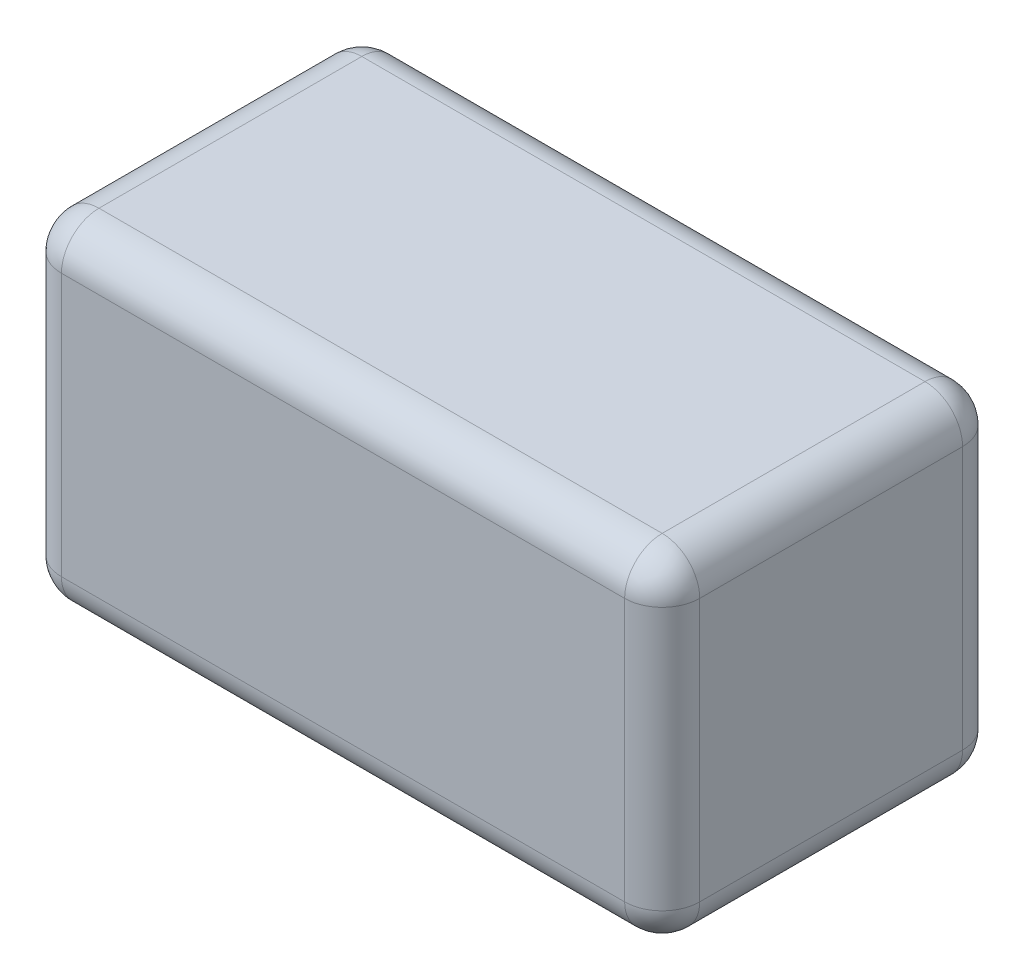
ISO-10303-21;
HEADER;
FILE_DESCRIPTION(('STEP AP214'),'2;1');
FILE_NAME('part.step','',(''),(''),'','','');
FILE_SCHEMA(('AUTOMOTIVE_DESIGN { 1 0 10303 214 1 1 1 1 }'));
ENDSEC;
DATA;
#1=APPLICATION_CONTEXT('core data for automotive mechanical design processes');
#2=APPLICATION_PROTOCOL_DEFINITION('international standard','automotive_design',2000,#1);
#3=PRODUCT_CONTEXT('',#1,'mechanical');
#4=PRODUCT('Part','Part','',(#3));
#5=PRODUCT_RELATED_PRODUCT_CATEGORY('part','',(#4));
#6=PRODUCT_DEFINITION_FORMATION('','',#4);
#7=PRODUCT_DEFINITION_CONTEXT('part definition',#1,'design');
#8=PRODUCT_DEFINITION('design','',#6,#7);
#9=PRODUCT_DEFINITION_SHAPE('','',#8);
#10=(LENGTH_UNIT() NAMED_UNIT(*) SI_UNIT(.MILLI.,.METRE.));
#11=(NAMED_UNIT(*) PLANE_ANGLE_UNIT() SI_UNIT($,.RADIAN.));
#12=(NAMED_UNIT(*) SI_UNIT($,.STERADIAN.) SOLID_ANGLE_UNIT());
#13=UNCERTAINTY_MEASURE_WITH_UNIT(LENGTH_MEASURE(1.E-05),#10,'distance_accuracy_value','');
#14=(GEOMETRIC_REPRESENTATION_CONTEXT(3) GLOBAL_UNCERTAINTY_ASSIGNED_CONTEXT((#13)) GLOBAL_UNIT_ASSIGNED_CONTEXT((#10,
#11,#12)) REPRESENTATION_CONTEXT('',''));
#15=CARTESIAN_POINT('',(0.,0.,0.));
#16=DIRECTION('',(0.,0.,1.));
#17=DIRECTION('',(1.,0.,0.));
#18=AXIS2_PLACEMENT_3D('',#15,#16,#17);
#19=CARTESIAN_POINT('',(-3.427710128787,-22.06241513081,7.099162858095));
#20=DIRECTION('',(0.,0.,-1.));
#21=DIRECTION('',(-1.,0.,0.));
#22=AXIS2_PLACEMENT_3D('',#19,#20,#21);
#23=SPHERICAL_SURFACE('',#22,0.1);
#24=CARTESIAN_POINT('',(-3.427710128787,-22.06241513081,7.099162858095));
#25=DIRECTION('',(1.,0.,0.));
#26=DIRECTION('',(0.,0.,-1.));
#27=AXIS2_PLACEMENT_3D('',#24,#25,#26);
#28=CIRCLE('',#27,0.1);
#29=CARTESIAN_POINT('',(-3.427710128787,-22.062415130705,6.999162858095));
#30=VERTEX_POINT('',#29);
#31=CARTESIAN_POINT('',(-3.427710128787,-21.96241513081,7.099162857985));
#32=VERTEX_POINT('',#31);
#33=EDGE_CURVE('E91',#30,#32,#28,.T.);
#34=ORIENTED_EDGE('',*,*,#33,.F.);
#35=CARTESIAN_POINT('',(-3.427710128787,-22.06241513081,7.099162858095));
#36=DIRECTION('',(0.,1.,0.));
#37=DIRECTION('',(-1.,0.,0.));
#38=AXIS2_PLACEMENT_3D('',#35,#36,#37);
#39=CIRCLE('',#38,0.1);
#40=CARTESIAN_POINT('',(-3.527710128787,-22.06241513081,7.099162858095));
#41=VERTEX_POINT('',#40);
#42=EDGE_CURVE('E87',#41,#30,#39,.F.);
#43=ORIENTED_EDGE('',*,*,#42,.F.);
#44=CARTESIAN_POINT('',(-3.427710128787,-22.06241513081,7.099162858095));
#45=DIRECTION('',(0.,0.,-1.));
#46=DIRECTION('',(-1.,0.,0.));
#47=AXIS2_PLACEMENT_3D('',#44,#45,#46);
#48=CIRCLE('',#47,0.1);
#49=EDGE_CURVE('E89',#32,#41,#48,.F.);
#50=ORIENTED_EDGE('',*,*,#49,.F.);
#51=EDGE_LOOP('',(#34,#43,#50));
#52=FACE_BOUND('',#51,.T.);
#53=ADVANCED_FACE('F17',(#52),#23,.T.);
#54=CARTESIAN_POINT('',(-1.927710128787,-22.06241513081,7.099162858095));
#55=DIRECTION('',(1.,0.,0.));
#56=DIRECTION('',(0.,0.,-1.));
#57=AXIS2_PLACEMENT_3D('',#54,#55,#56);
#58=SPHERICAL_SURFACE('',#57,0.1);
#59=CARTESIAN_POINT('',(-1.927710128787,-22.06241513081,7.099162858095));
#60=DIRECTION('',(0.,-1.,0.));
#61=DIRECTION('',(1.,0.,0.));
#62=AXIS2_PLACEMENT_3D('',#59,#60,#61);
#63=CIRCLE('',#62,0.1);
#64=CARTESIAN_POINT('',(-1.927710128787,-22.06241513081,6.999162858095));
#65=VERTEX_POINT('',#64);
#66=CARTESIAN_POINT('',(-1.827710128787,-22.06241513081,7.099162858095));
#67=VERTEX_POINT('',#66);
#68=EDGE_CURVE('E53',#65,#67,#63,.T.);
#69=ORIENTED_EDGE('',*,*,#68,.F.);
#70=CARTESIAN_POINT('',(-1.927710128787,-22.06241513081,7.099162858095));
#71=DIRECTION('',(1.,0.,0.));
#72=DIRECTION('',(0.,0.,-1.));
#73=AXIS2_PLACEMENT_3D('',#70,#71,#72);
#74=CIRCLE('',#73,0.1);
#75=CARTESIAN_POINT('',(-1.927710128787,-21.96241513081,7.09916285804));
#76=VERTEX_POINT('',#75);
#77=EDGE_CURVE('E120',#76,#65,#74,.F.);
#78=ORIENTED_EDGE('',*,*,#77,.F.);
#79=CARTESIAN_POINT('',(-1.927710128787,-22.06241513081,7.099162858095));
#80=DIRECTION('',(0.,0.,-1.));
#81=DIRECTION('',(-1.,0.,0.));
#82=AXIS2_PLACEMENT_3D('',#79,#80,#81);
#83=CIRCLE('',#82,0.1);
#84=EDGE_CURVE('E105',#67,#76,#83,.F.);
#85=ORIENTED_EDGE('',*,*,#84,.F.);
#86=EDGE_LOOP('',(#69,#78,#85));
#87=FACE_BOUND('',#86,.T.);
#88=ADVANCED_FACE('F203',(#87),#58,.T.);
#89=CARTESIAN_POINT('',(-3.427710128787,-21.56241513081,7.099162858095));
#90=DIRECTION('',(0.,1.,0.));
#91=DIRECTION('',(-1.,0.,0.));
#92=AXIS2_PLACEMENT_3D('',#89,#90,#91);
#93=CYLINDRICAL_SURFACE('',#92,0.1);
#94=CARTESIAN_POINT('',(-3.427710128787,-22.76241513081,7.099162858095));
#95=DIRECTION('',(0.,-1.,0.));
#96=DIRECTION('',(-1.,0.,0.));
#97=AXIS2_PLACEMENT_3D('',#94,#95,#96);
#98=CIRCLE('',#97,0.1);
#99=CARTESIAN_POINT('',(-3.527710128787,-22.76241513081,7.099162858095));
#100=VERTEX_POINT('',#99);
#101=CARTESIAN_POINT('',(-3.427710128787,-22.76241513081,6.999162858095));
#102=VERTEX_POINT('',#101);
#103=EDGE_CURVE('E80',#100,#102,#98,.T.);
#104=ORIENTED_EDGE('',*,*,#103,.F.);
#105=DIRECTION('',(0.,1.,0.));
#106=VECTOR('',#105,1.);
#107=CARTESIAN_POINT('',(-3.527710128787,-21.96241513081,7.099162858095));
#108=LINE('',#107,#106);
#109=EDGE_CURVE('E107',#41,#100,#108,.F.);
#110=ORIENTED_EDGE('',*,*,#109,.F.);
#111=ORIENTED_EDGE('',*,*,#42,.T.);
#112=DIRECTION('',(0.,1.,0.));
#113=VECTOR('',#112,1.);
#114=CARTESIAN_POINT('',(-3.427710128787,-22.86241513081,6.999162858095));
#115=LINE('',#114,#113);
#116=EDGE_CURVE('E158',#30,#102,#115,.F.);
#117=ORIENTED_EDGE('',*,*,#116,.T.);
#118=EDGE_LOOP('',(#104,#110,#111,#117));
#119=FACE_BOUND('',#118,.T.);
#120=ADVANCED_FACE('F108',(#119),#93,.T.);
#121=CARTESIAN_POINT('',(-3.427710128787,-22.76241513081,7.099162858095));
#122=DIRECTION('',(-1.,0.,0.));
#123=DIRECTION('',(0.,0.,-1.));
#124=AXIS2_PLACEMENT_3D('',#121,#122,#123);
#125=SPHERICAL_SURFACE('',#124,0.1);
#126=CARTESIAN_POINT('',(-3.427710128787,-22.76241513081,7.099162858095));
#127=DIRECTION('',(-1.,0.,0.));
#128=DIRECTION('',(0.,0.,1.));
#129=AXIS2_PLACEMENT_3D('',#126,#127,#128);
#130=CIRCLE('',#129,0.1);
#131=CARTESIAN_POINT('',(-3.427710128787,-22.86241513081,7.09916285806738));
#132=VERTEX_POINT('',#131);
#133=EDGE_CURVE('E192',#132,#102,#130,.F.);
#134=ORIENTED_EDGE('',*,*,#133,.F.);
#135=CARTESIAN_POINT('',(-3.427710128787,-22.76241513081,7.099162858095));
#136=DIRECTION('',(0.,0.,-1.));
#137=DIRECTION('',(-1.,0.,0.));
#138=AXIS2_PLACEMENT_3D('',#135,#136,#137);
#139=CIRCLE('',#138,0.1);
#140=EDGE_CURVE('E189',#100,#132,#139,.F.);
#141=ORIENTED_EDGE('',*,*,#140,.F.);
#142=ORIENTED_EDGE('',*,*,#103,.T.);
#143=EDGE_LOOP('',(#134,#141,#142));
#144=FACE_BOUND('',#143,.T.);
#145=ADVANCED_FACE('F176',(#144),#125,.T.);
#146=CARTESIAN_POINT('',(-2.677710128787,-22.86241513081,6.999162858095));
#147=DIRECTION('',(0.,0.,1.));
#148=DIRECTION('',(1.,0.,0.));
#149=AXIS2_PLACEMENT_3D('',#146,#147,#148);
#150=PLANE('',#149);
#151=DIRECTION('',(-1.,0.,0.));
#152=VECTOR('',#151,1.);
#153=CARTESIAN_POINT('',(-3.827710128787,-22.76241513103,6.999162858095));
#154=LINE('',#153,#152);
#155=CARTESIAN_POINT('',(-1.927710128787,-22.76241513092,6.999162858095));
#156=VERTEX_POINT('',#155);
#157=EDGE_CURVE('E163',#102,#156,#154,.F.);
#158=ORIENTED_EDGE('',*,*,#157,.F.);
#159=ORIENTED_EDGE('',*,*,#116,.F.);
#160=DIRECTION('',(1.,0.,0.));
#161=VECTOR('',#160,1.);
#162=CARTESIAN_POINT('',(-2.677710128787,-22.06241513081,6.999162858095));
#163=LINE('',#162,#161);
#164=EDGE_CURVE('E21',#65,#30,#163,.F.);
#165=ORIENTED_EDGE('',*,*,#164,.F.);
#166=DIRECTION('',(0.,-1.,0.));
#167=VECTOR('',#166,1.);
#168=CARTESIAN_POINT('',(-1.927710128787,-23.26241513081,6.999162858095));
#169=LINE('',#168,#167);
#170=EDGE_CURVE('E61',#156,#65,#169,.F.);
#171=ORIENTED_EDGE('',*,*,#170,.F.);
#172=EDGE_LOOP('',(#158,#159,#165,#171));
#173=FACE_BOUND('',#172,.T.);
#174=ADVANCED_FACE('F171',(#173),#150,.F.);
#175=CARTESIAN_POINT('',(-1.927710128787,-22.76241513081,7.099162858095));
#176=DIRECTION('',(0.,0.,-1.));
#177=DIRECTION('',(1.,0.,0.));
#178=AXIS2_PLACEMENT_3D('',#175,#176,#177);
#179=SPHERICAL_SURFACE('',#178,0.1);
#180=CARTESIAN_POINT('',(-1.927710128787,-22.76241513081,7.099162858095));
#181=DIRECTION('',(0.,-1.,0.));
#182=DIRECTION('',(1.,0.,0.));
#183=AXIS2_PLACEMENT_3D('',#180,#181,#182);
#184=CIRCLE('',#183,0.1);
#185=CARTESIAN_POINT('',(-1.827710128787,-22.76241513081,7.099162858095));
#186=VERTEX_POINT('',#185);
#187=EDGE_CURVE('E152',#186,#156,#184,.F.);
#188=ORIENTED_EDGE('',*,*,#187,.F.);
#189=CARTESIAN_POINT('',(-1.927710128787,-22.76241513081,7.099162858095));
#190=DIRECTION('',(0.,0.,-1.));
#191=DIRECTION('',(-1.,0.,0.));
#192=AXIS2_PLACEMENT_3D('',#189,#190,#191);
#193=CIRCLE('',#192,0.1);
#194=CARTESIAN_POINT('',(-1.927710128787,-22.86241513081,7.0991628579845));
#195=VERTEX_POINT('',#194);
#196=EDGE_CURVE('E112',#195,#186,#193,.F.);
#197=ORIENTED_EDGE('',*,*,#196,.F.);
#198=CARTESIAN_POINT('',(-1.927710128787,-22.76241513081,7.099162858095));
#199=DIRECTION('',(-1.,0.,0.));
#200=DIRECTION('',(0.,0.,1.));
#201=AXIS2_PLACEMENT_3D('',#198,#199,#200);
#202=CIRCLE('',#201,0.1);
#203=EDGE_CURVE('E329',#156,#195,#202,.T.);
#204=ORIENTED_EDGE('',*,*,#203,.F.);
#205=EDGE_LOOP('',(#188,#197,#204));
#206=FACE_BOUND('',#205,.T.);
#207=ADVANCED_FACE('F166',(#206),#179,.T.);
#208=CARTESIAN_POINT('',(-1.927710128787,-23.26241513081,7.099162858095));
#209=DIRECTION('',(0.,-1.,0.));
#210=DIRECTION('',(1.,0.,0.));
#211=AXIS2_PLACEMENT_3D('',#208,#209,#210);
#212=CYLINDRICAL_SURFACE('',#211,0.1);
#213=ORIENTED_EDGE('',*,*,#187,.T.);
#214=ORIENTED_EDGE('',*,*,#170,.T.);
#215=ORIENTED_EDGE('',*,*,#68,.T.);
#216=DIRECTION('',(0.,1.,0.));
#217=VECTOR('',#216,1.);
#218=CARTESIAN_POINT('',(-1.827710128787,-22.86241513081,7.099162858095));
#219=LINE('',#218,#217);
#220=EDGE_CURVE('E146',#186,#67,#219,.T.);
#221=ORIENTED_EDGE('',*,*,#220,.F.);
#222=EDGE_LOOP('',(#213,#214,#215,#221));
#223=FACE_BOUND('',#222,.T.);
#224=ADVANCED_FACE('F170',(#223),#212,.T.);
#225=CARTESIAN_POINT('',(-3.427710128787,-22.06241513081,6.699162858095));
#226=DIRECTION('',(0.,0.,-1.));
#227=DIRECTION('',(-1.,0.,0.));
#228=AXIS2_PLACEMENT_3D('',#225,#226,#227);
#229=CYLINDRICAL_SURFACE('',#228,0.1);
#230=DIRECTION('',(0.,0.,1.));
#231=VECTOR('',#230,1.);
#232=CARTESIAN_POINT('',(-3.527710128787,-22.06241513081,6.999162858095));
#233=LINE('',#232,#231);
#234=CARTESIAN_POINT('',(-3.527710128787,-22.06241513081,7.799162858095));
#235=VERTEX_POINT('',#234);
#236=EDGE_CURVE('E101',#235,#41,#233,.F.);
#237=ORIENTED_EDGE('',*,*,#236,.F.);
#238=CARTESIAN_POINT('',(-3.427710128787,-22.06241513081,7.799162858095));
#239=DIRECTION('',(0.,0.,-1.));
#240=DIRECTION('',(-1.,0.,0.));
#241=AXIS2_PLACEMENT_3D('',#238,#239,#240);
#242=CIRCLE('',#241,0.1);
#243=CARTESIAN_POINT('',(-3.427710128787,-21.96241513081,7.7991628582055));
#244=VERTEX_POINT('',#243);
#245=EDGE_CURVE('E308',#244,#235,#242,.F.);
#246=ORIENTED_EDGE('',*,*,#245,.F.);
#247=DIRECTION('',(0.,0.,1.));
#248=VECTOR('',#247,1.);
#249=CARTESIAN_POINT('',(-3.427710128787,-21.96241513081,6.999162858095));
#250=LINE('',#249,#248);
#251=EDGE_CURVE('E104',#32,#244,#250,.T.);
#252=ORIENTED_EDGE('',*,*,#251,.F.);
#253=ORIENTED_EDGE('',*,*,#49,.T.);
#254=EDGE_LOOP('',(#237,#246,#252,#253));
#255=FACE_BOUND('',#254,.T.);
#256=ADVANCED_FACE('F97',(#255),#229,.T.);
#257=CARTESIAN_POINT('',(-1.927710128787,-22.06241513081,6.699162858095));
#258=DIRECTION('',(0.,0.,-1.));
#259=DIRECTION('',(-1.,0.,0.));
#260=AXIS2_PLACEMENT_3D('',#257,#258,#259);
#261=CYLINDRICAL_SURFACE('',#260,0.1);
#262=DIRECTION('',(0.,0.,1.));
#263=VECTOR('',#262,1.);
#264=CARTESIAN_POINT('',(-1.927710128787,-21.96241513081,6.999162858095));
#265=LINE('',#264,#263);
#266=CARTESIAN_POINT('',(-1.927710128787,-21.96241513081,7.799162858095));
#267=VERTEX_POINT('',#266);
#268=EDGE_CURVE('E141',#267,#76,#265,.F.);
#269=ORIENTED_EDGE('',*,*,#268,.F.);
#270=CARTESIAN_POINT('',(-1.927710128787,-22.06241513081,7.799162858095));
#271=DIRECTION('',(0.,0.,1.));
#272=DIRECTION('',(1.,0.,0.));
#273=AXIS2_PLACEMENT_3D('',#270,#271,#272);
#274=CIRCLE('',#273,0.1);
#275=CARTESIAN_POINT('',(-1.827710128787,-22.06241513081,7.799162858095));
#276=VERTEX_POINT('',#275);
#277=EDGE_CURVE('E287',#276,#267,#274,.T.);
#278=ORIENTED_EDGE('',*,*,#277,.F.);
#279=DIRECTION('',(0.,0.,-1.));
#280=VECTOR('',#279,1.);
#281=CARTESIAN_POINT('',(-1.827710128787,-22.06241513081,6.999162858095));
#282=LINE('',#281,#280);
#283=EDGE_CURVE('E324',#67,#276,#282,.F.);
#284=ORIENTED_EDGE('',*,*,#283,.F.);
#285=ORIENTED_EDGE('',*,*,#84,.T.);
#286=EDGE_LOOP('',(#269,#278,#284,#285));
#287=FACE_BOUND('',#286,.T.);
#288=ADVANCED_FACE('F428',(#287),#261,.T.);
#289=CARTESIAN_POINT('',(-1.527710128787,-22.06241513081,7.099162858095));
#290=DIRECTION('',(1.,0.,0.));
#291=DIRECTION('',(0.,0.,-1.));
#292=AXIS2_PLACEMENT_3D('',#289,#290,#291);
#293=CYLINDRICAL_SURFACE('',#292,0.1);
#294=ORIENTED_EDGE('',*,*,#77,.T.);
#295=ORIENTED_EDGE('',*,*,#164,.T.);
#296=ORIENTED_EDGE('',*,*,#33,.T.);
#297=DIRECTION('',(-1.,0.,0.));
#298=VECTOR('',#297,1.);
#299=CARTESIAN_POINT('',(-1.827710128787,-21.96241513081,7.099162858095));
#300=LINE('',#299,#298);
#301=EDGE_CURVE('E137',#76,#32,#300,.T.);
#302=ORIENTED_EDGE('',*,*,#301,.F.);
#303=EDGE_LOOP('',(#294,#295,#296,#302));
#304=FACE_BOUND('',#303,.T.);
#305=ADVANCED_FACE('F389',(#304),#293,.T.);
#306=CARTESIAN_POINT('',(-3.527710128787,-21.96241513081,6.999162858095));
#307=DIRECTION('',(-1.,0.,0.));
#308=DIRECTION('',(0.,0.,1.));
#309=AXIS2_PLACEMENT_3D('',#306,#307,#308);
#310=PLANE('',#309);
#311=DIRECTION('',(0.,0.,-1.));
#312=VECTOR('',#311,1.);
#313=CARTESIAN_POINT('',(-3.527710128787,-22.76241513081,6.699162858095));
#314=LINE('',#313,#312);
#315=CARTESIAN_POINT('',(-3.527710128787,-22.76241513081,7.799162858095));
#316=VERTEX_POINT('',#315);
#317=EDGE_CURVE('E193',#316,#100,#314,.T.);
#318=ORIENTED_EDGE('',*,*,#317,.F.);
#319=DIRECTION('',(0.,-1.,0.));
#320=VECTOR('',#319,1.);
#321=CARTESIAN_POINT('',(-3.527710128787,-21.56241513081,7.799162858095));
#322=LINE('',#321,#320);
#323=EDGE_CURVE('E117',#235,#316,#322,.T.);
#324=ORIENTED_EDGE('',*,*,#323,.F.);
#325=ORIENTED_EDGE('',*,*,#236,.T.);
#326=ORIENTED_EDGE('',*,*,#109,.T.);
#327=EDGE_LOOP('',(#318,#324,#325,#326));
#328=FACE_BOUND('',#327,.T.);
#329=ADVANCED_FACE('F115',(#328),#310,.T.);
#330=CARTESIAN_POINT('',(-1.927710128787,-22.76241513081,6.699162858095));
#331=DIRECTION('',(0.,0.,-1.));
#332=DIRECTION('',(-1.,0.,0.));
#333=AXIS2_PLACEMENT_3D('',#330,#331,#332);
#334=CYLINDRICAL_SURFACE('',#333,0.1);
#335=DIRECTION('',(0.,0.,-1.));
#336=VECTOR('',#335,1.);
#337=CARTESIAN_POINT('',(-1.827710128787,-22.76241513081,6.999162858095));
#338=LINE('',#337,#336);
#339=CARTESIAN_POINT('',(-1.827710128787,-22.76241513081,7.799162858095));
#340=VERTEX_POINT('',#339);
#341=EDGE_CURVE('E149',#340,#186,#338,.T.);
#342=ORIENTED_EDGE('',*,*,#341,.F.);
#343=CARTESIAN_POINT('',(-1.927710128787,-22.76241513081,7.799162858095));
#344=DIRECTION('',(0.,0.,-1.));
#345=DIRECTION('',(1.,0.,0.));
#346=AXIS2_PLACEMENT_3D('',#343,#344,#345);
#347=CIRCLE('',#346,0.1);
#348=CARTESIAN_POINT('',(-1.927710128787,-22.86241513081,7.7991628582055));
#349=VERTEX_POINT('',#348);
#350=EDGE_CURVE('E267',#349,#340,#347,.F.);
#351=ORIENTED_EDGE('',*,*,#350,.F.);
#352=DIRECTION('',(0.,0.,1.));
#353=VECTOR('',#352,1.);
#354=CARTESIAN_POINT('',(-1.927710128787,-22.86241513081,6.999162858095));
#355=LINE('',#354,#353);
#356=EDGE_CURVE('E270',#195,#349,#355,.T.);
#357=ORIENTED_EDGE('',*,*,#356,.F.);
#358=ORIENTED_EDGE('',*,*,#196,.T.);
#359=EDGE_LOOP('',(#342,#351,#357,#358));
#360=FACE_BOUND('',#359,.T.);
#361=ADVANCED_FACE('F451',(#360),#334,.T.);
#362=CARTESIAN_POINT('',(-3.427710128787,-22.76241513081,6.699162858095));
#363=DIRECTION('',(0.,0.,-1.));
#364=DIRECTION('',(-1.,0.,0.));
#365=AXIS2_PLACEMENT_3D('',#362,#363,#364);
#366=CYLINDRICAL_SURFACE('',#365,0.1);
#367=DIRECTION('',(0.,0.,1.));
#368=VECTOR('',#367,1.);
#369=CARTESIAN_POINT('',(-3.427710128787,-22.86241513081,6.999162858095));
#370=LINE('',#369,#368);
#371=CARTESIAN_POINT('',(-3.427710128787,-22.86241513081,7.79916285811217));
#372=VERTEX_POINT('',#371);
#373=EDGE_CURVE('E262',#372,#132,#370,.F.);
#374=ORIENTED_EDGE('',*,*,#373,.F.);
#375=CARTESIAN_POINT('',(-3.427710128787,-22.76241513081,7.799162858095));
#376=DIRECTION('',(0.,0.,1.));
#377=DIRECTION('',(-1.,0.,0.));
#378=AXIS2_PLACEMENT_3D('',#375,#376,#377);
#379=CIRCLE('',#378,0.0999999999999998);
#380=EDGE_CURVE('E263',#316,#372,#379,.T.);
#381=ORIENTED_EDGE('',*,*,#380,.F.);
#382=ORIENTED_EDGE('',*,*,#317,.T.);
#383=ORIENTED_EDGE('',*,*,#140,.T.);
#384=EDGE_LOOP('',(#374,#381,#382,#383));
#385=FACE_BOUND('',#384,.T.);
#386=ADVANCED_FACE('F372',(#385),#366,.T.);
#387=CARTESIAN_POINT('',(-3.827710128787,-22.76241513081,7.099162858095));
#388=DIRECTION('',(-1.,0.,0.));
#389=DIRECTION('',(0.,0.,1.));
#390=AXIS2_PLACEMENT_3D('',#387,#388,#389);
#391=CYLINDRICAL_SURFACE('',#390,0.1);
#392=ORIENTED_EDGE('',*,*,#203,.T.);
#393=DIRECTION('',(1.,0.,0.));
#394=VECTOR('',#393,1.);
#395=CARTESIAN_POINT('',(-3.527710128787,-22.86241513081,7.099162858095));
#396=LINE('',#395,#394);
#397=EDGE_CURVE('E332',#132,#195,#396,.T.);
#398=ORIENTED_EDGE('',*,*,#397,.F.);
#399=ORIENTED_EDGE('',*,*,#133,.T.);
#400=ORIENTED_EDGE('',*,*,#157,.T.);
#401=EDGE_LOOP('',(#392,#398,#399,#400));
#402=FACE_BOUND('',#401,.T.);
#403=ADVANCED_FACE('F478',(#402),#391,.T.);
#404=CARTESIAN_POINT('',(-1.827710128787,-22.86241513081,6.999162858095));
#405=DIRECTION('',(1.,0.,0.));
#406=DIRECTION('',(0.,0.,-1.));
#407=AXIS2_PLACEMENT_3D('',#404,#405,#406);
#408=PLANE('',#407);
#409=ORIENTED_EDGE('',*,*,#341,.T.);
#410=ORIENTED_EDGE('',*,*,#220,.T.);
#411=ORIENTED_EDGE('',*,*,#283,.T.);
#412=DIRECTION('',(0.,1.,0.));
#413=VECTOR('',#412,1.);
#414=CARTESIAN_POINT('',(-1.827710128787,-23.26241513081,7.799162858095));
#415=LINE('',#414,#413);
#416=EDGE_CURVE('E315',#340,#276,#415,.T.);
#417=ORIENTED_EDGE('',*,*,#416,.F.);
#418=EDGE_LOOP('',(#409,#410,#411,#417));
#419=FACE_BOUND('',#418,.T.);
#420=ADVANCED_FACE('F300',(#419),#408,.T.);
#421=CARTESIAN_POINT('',(-3.427710128787,-22.06241513081,7.799162858095));
#422=DIRECTION('',(-1.,0.,0.));
#423=DIRECTION('',(0.,0.,1.));
#424=AXIS2_PLACEMENT_3D('',#421,#422,#423);
#425=SPHERICAL_SURFACE('',#424,0.1);
#426=CARTESIAN_POINT('',(-3.427710128787,-22.06241513081,7.799162858095));
#427=DIRECTION('',(-1.,0.,0.));
#428=DIRECTION('',(0.,0.,1.));
#429=AXIS2_PLACEMENT_3D('',#426,#427,#428);
#430=CIRCLE('',#429,0.1);
#431=CARTESIAN_POINT('',(-3.427710128787,-22.062415130695,7.899162858095));
#432=VERTEX_POINT('',#431);
#433=EDGE_CURVE('E318',#244,#432,#430,.F.);
#434=ORIENTED_EDGE('',*,*,#433,.F.);
#435=ORIENTED_EDGE('',*,*,#245,.T.);
#436=CARTESIAN_POINT('',(-3.427710128787,-22.06241513081,7.799162858095));
#437=DIRECTION('',(0.,-1.,0.));
#438=DIRECTION('',(1.,0.,0.));
#439=AXIS2_PLACEMENT_3D('',#436,#437,#438);
#440=CIRCLE('',#439,0.1);
#441=EDGE_CURVE('E140',#432,#235,#440,.T.);
#442=ORIENTED_EDGE('',*,*,#441,.F.);
#443=EDGE_LOOP('',(#434,#435,#442));
#444=FACE_BOUND('',#443,.T.);
#445=ADVANCED_FACE('F295',(#444),#425,.T.);
#446=CARTESIAN_POINT('',(-1.927710128787,-22.06241513081,7.799162858095));
#447=DIRECTION('',(0.,0.,1.));
#448=DIRECTION('',(1.,0.,0.));
#449=AXIS2_PLACEMENT_3D('',#446,#447,#448);
#450=SPHERICAL_SURFACE('',#449,0.1);
#451=ORIENTED_EDGE('',*,*,#277,.T.);
#452=CARTESIAN_POINT('',(-1.927710128787,-22.06241513081,7.799162858095));
#453=DIRECTION('',(-1.,0.,0.));
#454=DIRECTION('',(0.,0.,1.));
#455=AXIS2_PLACEMENT_3D('',#452,#453,#454);
#456=CIRCLE('',#455,0.1);
#457=CARTESIAN_POINT('',(-1.927710128787,-22.06241513081,7.899162858095));
#458=VERTEX_POINT('',#457);
#459=EDGE_CURVE('E424',#458,#267,#456,.T.);
#460=ORIENTED_EDGE('',*,*,#459,.F.);
#461=CARTESIAN_POINT('',(-1.927710128787,-22.06241513081,7.799162858095));
#462=DIRECTION('',(0.,1.,0.));
#463=DIRECTION('',(-1.,0.,0.));
#464=AXIS2_PLACEMENT_3D('',#461,#462,#463);
#465=CIRCLE('',#464,0.1);
#466=EDGE_CURVE('E335',#276,#458,#465,.F.);
#467=ORIENTED_EDGE('',*,*,#466,.F.);
#468=EDGE_LOOP('',(#451,#460,#467));
#469=FACE_BOUND('',#468,.T.);
#470=ADVANCED_FACE('F290',(#469),#450,.T.);
#471=CARTESIAN_POINT('',(-1.827710128787,-21.96241513081,6.999162858095));
#472=DIRECTION('',(0.,1.,0.));
#473=DIRECTION('',(-1.,0.,0.));
#474=AXIS2_PLACEMENT_3D('',#471,#472,#473);
#475=PLANE('',#474);
#476=ORIENTED_EDGE('',*,*,#301,.T.);
#477=ORIENTED_EDGE('',*,*,#251,.T.);
#478=DIRECTION('',(-1.,0.,0.));
#479=VECTOR('',#478,1.);
#480=CARTESIAN_POINT('',(-1.527710128787,-21.96241513081,7.799162858095));
#481=LINE('',#480,#479);
#482=EDGE_CURVE('E250',#267,#244,#481,.T.);
#483=ORIENTED_EDGE('',*,*,#482,.F.);
#484=ORIENTED_EDGE('',*,*,#268,.T.);
#485=EDGE_LOOP('',(#476,#477,#483,#484));
#486=FACE_BOUND('',#485,.T.);
#487=ADVANCED_FACE('F294',(#486),#475,.T.);
#488=CARTESIAN_POINT('',(-3.427710128787,-21.56241513081,7.799162858095));
#489=DIRECTION('',(0.,-1.,0.));
#490=DIRECTION('',(1.,0.,0.));
#491=AXIS2_PLACEMENT_3D('',#488,#489,#490);
#492=CYLINDRICAL_SURFACE('',#491,0.1);
#493=CARTESIAN_POINT('',(-3.427710128787,-22.76241513081,7.799162858095));
#494=DIRECTION('',(0.,-1.,0.));
#495=DIRECTION('',(0.,0.,1.));
#496=AXIS2_PLACEMENT_3D('',#493,#494,#495);
#497=CIRCLE('',#496,0.1);
#498=CARTESIAN_POINT('',(-3.427710128787,-22.762415130975,7.899162858095));
#499=VERTEX_POINT('',#498);
#500=EDGE_CURVE('E259',#499,#316,#497,.T.);
#501=ORIENTED_EDGE('',*,*,#500,.F.);
#502=DIRECTION('',(0.,1.,0.));
#503=VECTOR('',#502,1.);
#504=CARTESIAN_POINT('',(-3.427710128787,-22.86241513081,7.899162858095));
#505=LINE('',#504,#503);
#506=EDGE_CURVE('E246',#432,#499,#505,.F.);
#507=ORIENTED_EDGE('',*,*,#506,.F.);
#508=ORIENTED_EDGE('',*,*,#441,.T.);
#509=ORIENTED_EDGE('',*,*,#323,.T.);
#510=EDGE_LOOP('',(#501,#507,#508,#509));
#511=FACE_BOUND('',#510,.T.);
#512=ADVANCED_FACE('F441',(#511),#492,.T.);
#513=CARTESIAN_POINT('',(-1.927710128787,-22.76241513081,7.799162858095));
#514=DIRECTION('',(1.,0.,0.));
#515=DIRECTION('',(0.,0.,1.));
#516=AXIS2_PLACEMENT_3D('',#513,#514,#515);
#517=SPHERICAL_SURFACE('',#516,0.1);
#518=ORIENTED_EDGE('',*,*,#350,.T.);
#519=CARTESIAN_POINT('',(-1.927710128787,-22.76241513081,7.799162858095));
#520=DIRECTION('',(0.,1.,0.));
#521=DIRECTION('',(-1.,0.,0.));
#522=AXIS2_PLACEMENT_3D('',#519,#520,#521);
#523=CIRCLE('',#522,0.1);
#524=CARTESIAN_POINT('',(-1.927710128787,-22.762415130925,7.899162858095));
#525=VERTEX_POINT('',#524);
#526=EDGE_CURVE('E319',#525,#340,#523,.T.);
#527=ORIENTED_EDGE('',*,*,#526,.F.);
#528=CARTESIAN_POINT('',(-1.927710128787,-22.76241513081,7.799162858095));
#529=DIRECTION('',(1.,0.,0.));
#530=DIRECTION('',(0.,0.,-1.));
#531=AXIS2_PLACEMENT_3D('',#528,#529,#530);
#532=CIRCLE('',#531,0.1);
#533=EDGE_CURVE('E249',#349,#525,#532,.F.);
#534=ORIENTED_EDGE('',*,*,#533,.F.);
#535=EDGE_LOOP('',(#518,#527,#534));
#536=FACE_BOUND('',#535,.T.);
#537=ADVANCED_FACE('F237',(#536),#517,.T.);
#538=CARTESIAN_POINT('',(-3.427710128787,-22.76241513081,7.799162858095));
#539=DIRECTION('',(0.,0.,1.));
#540=DIRECTION('',(-1.,0.,0.));
#541=AXIS2_PLACEMENT_3D('',#538,#539,#540);
#542=SPHERICAL_SURFACE('',#541,0.1);
#543=CARTESIAN_POINT('',(-3.427710128787,-22.76241513081,7.799162858095));
#544=DIRECTION('',(1.,0.,0.));
#545=DIRECTION('',(0.,0.,-1.));
#546=AXIS2_PLACEMENT_3D('',#543,#544,#545);
#547=CIRCLE('',#546,0.1);
#548=EDGE_CURVE('E253',#499,#372,#547,.T.);
#549=ORIENTED_EDGE('',*,*,#548,.F.);
#550=ORIENTED_EDGE('',*,*,#500,.T.);
#551=ORIENTED_EDGE('',*,*,#380,.T.);
#552=EDGE_LOOP('',(#549,#550,#551));
#553=FACE_BOUND('',#552,.T.);
#554=ADVANCED_FACE('F232',(#553),#542,.T.);
#555=CARTESIAN_POINT('',(-3.527710128787,-22.86241513081,6.999162858095));
#556=DIRECTION('',(0.,-1.,0.));
#557=DIRECTION('',(1.,0.,0.));
#558=AXIS2_PLACEMENT_3D('',#555,#556,#557);
#559=PLANE('',#558);
#560=ORIENTED_EDGE('',*,*,#397,.T.);
#561=ORIENTED_EDGE('',*,*,#356,.T.);
#562=DIRECTION('',(1.,0.,0.));
#563=VECTOR('',#562,1.);
#564=CARTESIAN_POINT('',(-3.827710128787,-22.86241513081,7.799162858095));
#565=LINE('',#564,#563);
#566=EDGE_CURVE('E256',#372,#349,#565,.T.);
#567=ORIENTED_EDGE('',*,*,#566,.F.);
#568=ORIENTED_EDGE('',*,*,#373,.T.);
#569=EDGE_LOOP('',(#560,#561,#567,#568));
#570=FACE_BOUND('',#569,.T.);
#571=ADVANCED_FACE('F228',(#570),#559,.T.);
#572=CARTESIAN_POINT('',(-1.927710128787,-23.26241513081,7.799162858095));
#573=DIRECTION('',(0.,1.,0.));
#574=DIRECTION('',(-1.,0.,0.));
#575=AXIS2_PLACEMENT_3D('',#572,#573,#574);
#576=CYLINDRICAL_SURFACE('',#575,0.1);
#577=ORIENTED_EDGE('',*,*,#526,.T.);
#578=ORIENTED_EDGE('',*,*,#416,.T.);
#579=ORIENTED_EDGE('',*,*,#466,.T.);
#580=DIRECTION('',(0.,1.,0.));
#581=VECTOR('',#580,1.);
#582=CARTESIAN_POINT('',(-1.927710128787,-22.86241513081,7.899162858095));
#583=LINE('',#582,#581);
#584=EDGE_CURVE('E279',#525,#458,#583,.T.);
#585=ORIENTED_EDGE('',*,*,#584,.F.);
#586=EDGE_LOOP('',(#577,#578,#579,#585));
#587=FACE_BOUND('',#586,.T.);
#588=ADVANCED_FACE('F225',(#587),#576,.T.);
#589=CARTESIAN_POINT('',(-1.527710128787,-22.06241513081,7.799162858095));
#590=DIRECTION('',(-1.,0.,0.));
#591=DIRECTION('',(0.,0.,1.));
#592=AXIS2_PLACEMENT_3D('',#589,#590,#591);
#593=CYLINDRICAL_SURFACE('',#592,0.1);
#594=ORIENTED_EDGE('',*,*,#459,.T.);
#595=ORIENTED_EDGE('',*,*,#482,.T.);
#596=ORIENTED_EDGE('',*,*,#433,.T.);
#597=DIRECTION('',(1.,0.,0.));
#598=VECTOR('',#597,1.);
#599=CARTESIAN_POINT('',(-2.677710128787,-22.06241513059,7.899162858095));
#600=LINE('',#599,#598);
#601=EDGE_CURVE('E27',#458,#432,#600,.F.);
#602=ORIENTED_EDGE('',*,*,#601,.F.);
#603=EDGE_LOOP('',(#594,#595,#596,#602));
#604=FACE_BOUND('',#603,.T.);
#605=ADVANCED_FACE('F218',(#604),#593,.T.);
#606=CARTESIAN_POINT('',(-3.827710128787,-22.76241513081,7.799162858095));
#607=DIRECTION('',(1.,0.,0.));
#608=DIRECTION('',(0.,0.,-1.));
#609=AXIS2_PLACEMENT_3D('',#606,#607,#608);
#610=CYLINDRICAL_SURFACE('',#609,0.1);
#611=ORIENTED_EDGE('',*,*,#548,.T.);
#612=ORIENTED_EDGE('',*,*,#566,.T.);
#613=ORIENTED_EDGE('',*,*,#533,.T.);
#614=DIRECTION('',(1.,0.,0.));
#615=VECTOR('',#614,1.);
#616=CARTESIAN_POINT('',(-2.677710128787,-22.76241513103,7.899162858095));
#617=LINE('',#616,#615);
#618=EDGE_CURVE('E11',#499,#525,#617,.T.);
#619=ORIENTED_EDGE('',*,*,#618,.F.);
#620=EDGE_LOOP('',(#611,#612,#613,#619));
#621=FACE_BOUND('',#620,.T.);
#622=ADVANCED_FACE('F212',(#621),#610,.T.);
#623=CARTESIAN_POINT('',(-2.677710128787,-22.86241513081,7.899162858095));
#624=DIRECTION('',(0.,0.,1.));
#625=DIRECTION('',(1.,0.,0.));
#626=AXIS2_PLACEMENT_3D('',#623,#624,#625);
#627=PLANE('',#626);
#628=ORIENTED_EDGE('',*,*,#584,.T.);
#629=ORIENTED_EDGE('',*,*,#601,.T.);
#630=ORIENTED_EDGE('',*,*,#506,.T.);
#631=ORIENTED_EDGE('',*,*,#618,.T.);
#632=EDGE_LOOP('',(#628,#629,#630,#631));
#633=FACE_BOUND('',#632,.T.);
#634=ADVANCED_FACE('F210',(#633),#627,.T.);
#635=CLOSED_SHELL('',(#53,#88,#120,#145,#174,#207,#224,#256,#288,#305,#329,#361,#386,#403,#420,
#445,#470,#487,#512,#537,#554,#571,#588,#605,#622,#634));
#636=MANIFOLD_SOLID_BREP('B1',#635);
#637=ADVANCED_BREP_SHAPE_REPRESENTATION('',(#18,#636),#14);
#638=SHAPE_DEFINITION_REPRESENTATION(#9,#637);
ENDSEC;
END-ISO-10303-21;
